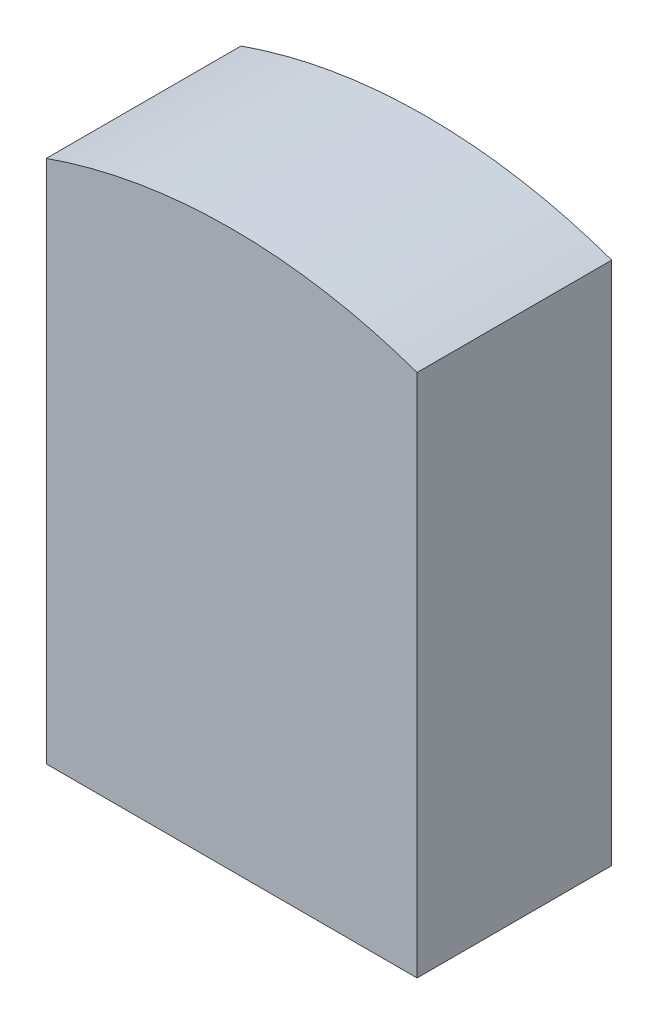
ISO-10303-21;
HEADER;
FILE_DESCRIPTION(('STEP AP214'),'2;1');
FILE_NAME('part.step','',(''),(''),'','','');
FILE_SCHEMA(('AUTOMOTIVE_DESIGN { 1 0 10303 214 1 1 1 1 }'));
ENDSEC;
DATA;
#1=APPLICATION_CONTEXT('core data for automotive mechanical design processes');
#2=APPLICATION_PROTOCOL_DEFINITION('international standard','automotive_design',2000,#1);
#3=PRODUCT_CONTEXT('',#1,'mechanical');
#4=PRODUCT('Part','Part','',(#3));
#5=PRODUCT_RELATED_PRODUCT_CATEGORY('part','',(#4));
#6=PRODUCT_DEFINITION_FORMATION('','',#4);
#7=PRODUCT_DEFINITION_CONTEXT('part definition',#1,'design');
#8=PRODUCT_DEFINITION('design','',#6,#7);
#9=PRODUCT_DEFINITION_SHAPE('','',#8);
#10=(LENGTH_UNIT() NAMED_UNIT(*) SI_UNIT(.MILLI.,.METRE.));
#11=(NAMED_UNIT(*) PLANE_ANGLE_UNIT() SI_UNIT($,.RADIAN.));
#12=(NAMED_UNIT(*) SI_UNIT($,.STERADIAN.) SOLID_ANGLE_UNIT());
#13=UNCERTAINTY_MEASURE_WITH_UNIT(LENGTH_MEASURE(1.E-05),#10,'distance_accuracy_value','');
#14=(GEOMETRIC_REPRESENTATION_CONTEXT(3) GLOBAL_UNCERTAINTY_ASSIGNED_CONTEXT((#13)) GLOBAL_UNIT_ASSIGNED_CONTEXT((#10,
#11,#12)) REPRESENTATION_CONTEXT('',''));
#15=CARTESIAN_POINT('',(0.,0.,0.));
#16=DIRECTION('',(0.,0.,1.));
#17=DIRECTION('',(1.,0.,0.));
#18=AXIS2_PLACEMENT_3D('',#15,#16,#17);
#19=CARTESIAN_POINT('',(8.45032449400135,-169.122807017544,70.));
#20=DIRECTION('',(1.,0.,0.));
#21=DIRECTION('',(0.,0.,-1.));
#22=AXIS2_PLACEMENT_3D('',#19,#20,#21);
#23=PLANE('',#22);
#24=DIRECTION('',(0.,-1.,0.));
#25=VECTOR('',#24,1.);
#26=CARTESIAN_POINT('',(8.45032449400135,-169.122807017544,0.));
#27=LINE('',#26,#25);
#28=CARTESIAN_POINT('',(8.45032449400135,19.4390012988688,0.));
#29=VERTEX_POINT('',#28);
#30=CARTESIAN_POINT('',(8.45032449400135,-169.122807017544,0.));
#31=VERTEX_POINT('',#30);
#32=EDGE_CURVE('E96',#29,#31,#27,.T.);
#33=ORIENTED_EDGE('',*,*,#32,.T.);
#34=DIRECTION('',(0.,0.,-1.));
#35=VECTOR('',#34,1.);
#36=CARTESIAN_POINT('',(8.45032449400135,-169.122807017544,70.));
#37=LINE('',#36,#35);
#38=CARTESIAN_POINT('',(8.45032449400135,-169.122807017544,70.));
#39=VERTEX_POINT('',#38);
#40=EDGE_CURVE('E11',#39,#31,#37,.T.);
#41=ORIENTED_EDGE('',*,*,#40,.F.);
#42=DIRECTION('',(0.,-1.,0.));
#43=VECTOR('',#42,1.);
#44=CARTESIAN_POINT('',(8.45032449400135,-169.122807017544,70.));
#45=LINE('',#44,#43);
#46=CARTESIAN_POINT('',(8.45032449400135,19.4390012988688,70.));
#47=VERTEX_POINT('',#46);
#48=EDGE_CURVE('E84',#47,#39,#45,.T.);
#49=ORIENTED_EDGE('',*,*,#48,.F.);
#50=DIRECTION('',(0.,0.,-1.));
#51=VECTOR('',#50,1.);
#52=CARTESIAN_POINT('',(8.45032449400135,19.4390012988688,70.));
#53=LINE('',#52,#51);
#54=EDGE_CURVE('E92',#47,#29,#53,.T.);
#55=ORIENTED_EDGE('',*,*,#54,.T.);
#56=EDGE_LOOP('',(#33,#41,#49,#55));
#57=FACE_BOUND('',#56,.T.);
#58=ADVANCED_FACE('F33',(#57),#23,.F.);
#59=CARTESIAN_POINT('',(8.45032449400135,-169.122807017544,70.));
#60=DIRECTION('',(0.,1.,0.));
#61=DIRECTION('',(0.,0.,1.));
#62=AXIS2_PLACEMENT_3D('',#59,#60,#61);
#63=PLANE('',#62);
#64=DIRECTION('',(1.,0.,0.));
#65=VECTOR('',#64,1.);
#66=CARTESIAN_POINT('',(8.45032449400135,-169.122807017544,0.));
#67=LINE('',#66,#65);
#68=CARTESIAN_POINT('',(141.783657827335,-169.122807017544,0.));
#69=VERTEX_POINT('',#68);
#70=EDGE_CURVE('E88',#31,#69,#67,.T.);
#71=ORIENTED_EDGE('',*,*,#70,.T.);
#72=DIRECTION('',(0.,0.,-1.));
#73=VECTOR('',#72,1.);
#74=CARTESIAN_POINT('',(141.783657827335,-169.122807017544,70.));
#75=LINE('',#74,#73);
#76=CARTESIAN_POINT('',(141.783657827335,-169.122807017544,70.));
#77=VERTEX_POINT('',#76);
#78=EDGE_CURVE('E41',#77,#69,#75,.T.);
#79=ORIENTED_EDGE('',*,*,#78,.F.);
#80=DIRECTION('',(1.,0.,0.));
#81=VECTOR('',#80,1.);
#82=CARTESIAN_POINT('',(8.45032449400135,-169.122807017544,70.));
#83=LINE('',#82,#81);
#84=EDGE_CURVE('E79',#39,#77,#83,.T.);
#85=ORIENTED_EDGE('',*,*,#84,.F.);
#86=ORIENTED_EDGE('',*,*,#40,.T.);
#87=EDGE_LOOP('',(#71,#79,#85,#86));
#88=FACE_BOUND('',#87,.T.);
#89=ADVANCED_FACE('F87',(#88),#63,.F.);
#90=CARTESIAN_POINT('',(141.783657827335,-169.122807017544,70.));
#91=DIRECTION('',(-1.,0.,0.));
#92=DIRECTION('',(0.,0.,1.));
#93=AXIS2_PLACEMENT_3D('',#90,#91,#92);
#94=PLANE('',#93);
#95=DIRECTION('',(0.,1.,0.));
#96=VECTOR('',#95,1.);
#97=CARTESIAN_POINT('',(141.783657827335,-169.122807017544,0.));
#98=LINE('',#97,#96);
#99=CARTESIAN_POINT('',(141.783657827335,19.4390012988688,0.));
#100=VERTEX_POINT('',#99);
#101=EDGE_CURVE('E66',#69,#100,#98,.T.);
#102=ORIENTED_EDGE('',*,*,#101,.T.);
#103=DIRECTION('',(0.,0.,-1.));
#104=VECTOR('',#103,1.);
#105=CARTESIAN_POINT('',(141.783657827335,19.4390012988688,70.));
#106=LINE('',#105,#104);
#107=CARTESIAN_POINT('',(141.783657827335,19.4390012988688,70.));
#108=VERTEX_POINT('',#107);
#109=EDGE_CURVE('E89',#108,#100,#106,.T.);
#110=ORIENTED_EDGE('',*,*,#109,.F.);
#111=DIRECTION('',(0.,1.,0.));
#112=VECTOR('',#111,1.);
#113=CARTESIAN_POINT('',(141.783657827335,-169.122807017544,70.));
#114=LINE('',#113,#112);
#115=EDGE_CURVE('E82',#77,#108,#114,.T.);
#116=ORIENTED_EDGE('',*,*,#115,.F.);
#117=ORIENTED_EDGE('',*,*,#78,.T.);
#118=EDGE_LOOP('',(#102,#110,#116,#117));
#119=FACE_BOUND('',#118,.T.);
#120=ADVANCED_FACE('F90',(#119),#94,.F.);
#121=CARTESIAN_POINT('',(75.116991160668,-169.122807017544,70.));
#122=DIRECTION('',(0.,0.,-1.));
#123=DIRECTION('',(-1.,0.,0.));
#124=AXIS2_PLACEMENT_3D('',#121,#122,#123);
#125=CYLINDRICAL_SURFACE('',#124,200.);
#126=CARTESIAN_POINT('',(75.116991160668,-169.122807017544,0.));
#127=DIRECTION('',(0.,0.,1.));
#128=DIRECTION('',(1.,0.,0.));
#129=AXIS2_PLACEMENT_3D('',#126,#127,#128);
#130=CIRCLE('',#129,200.);
#131=EDGE_CURVE('E72',#100,#29,#130,.T.);
#132=ORIENTED_EDGE('',*,*,#131,.T.);
#133=ORIENTED_EDGE('',*,*,#54,.F.);
#134=CARTESIAN_POINT('',(75.116991160668,-169.122807017544,70.));
#135=DIRECTION('',(0.,0.,1.));
#136=DIRECTION('',(1.,0.,0.));
#137=AXIS2_PLACEMENT_3D('',#134,#135,#136);
#138=CIRCLE('',#137,200.);
#139=EDGE_CURVE('E49',#108,#47,#138,.T.);
#140=ORIENTED_EDGE('',*,*,#139,.F.);
#141=ORIENTED_EDGE('',*,*,#109,.T.);
#142=EDGE_LOOP('',(#132,#133,#140,#141));
#143=FACE_BOUND('',#142,.T.);
#144=ADVANCED_FACE('F103',(#143),#125,.T.);
#145=CARTESIAN_POINT('',(75.116991160668,-169.122807017544,70.));
#146=DIRECTION('',(0.,0.,1.));
#147=DIRECTION('',(1.,0.,0.));
#148=AXIS2_PLACEMENT_3D('',#145,#146,#147);
#149=PLANE('',#148);
#150=ORIENTED_EDGE('',*,*,#48,.T.);
#151=ORIENTED_EDGE('',*,*,#84,.T.);
#152=ORIENTED_EDGE('',*,*,#115,.T.);
#153=ORIENTED_EDGE('',*,*,#139,.T.);
#154=EDGE_LOOP('',(#150,#151,#152,#153));
#155=FACE_BOUND('',#154,.T.);
#156=ADVANCED_FACE('F80',(#155),#149,.T.);
#157=CARTESIAN_POINT('',(75.116991160668,-169.122807017544,0.));
#158=DIRECTION('',(0.,0.,1.));
#159=DIRECTION('',(1.,0.,0.));
#160=AXIS2_PLACEMENT_3D('',#157,#158,#159);
#161=PLANE('',#160);
#162=ORIENTED_EDGE('',*,*,#32,.F.);
#163=ORIENTED_EDGE('',*,*,#131,.F.);
#164=ORIENTED_EDGE('',*,*,#101,.F.);
#165=ORIENTED_EDGE('',*,*,#70,.F.);
#166=EDGE_LOOP('',(#162,#163,#164,#165));
#167=FACE_BOUND('',#166,.T.);
#168=ADVANCED_FACE('F106',(#167),#161,.F.);
#169=CLOSED_SHELL('',(#58,#89,#120,#144,#156,#168));
#170=MANIFOLD_SOLID_BREP('B2',#169);
#171=ADVANCED_BREP_SHAPE_REPRESENTATION('',(#18,#170),#14);
#172=SHAPE_DEFINITION_REPRESENTATION(#9,#171);
ENDSEC;
END-ISO-10303-21;
